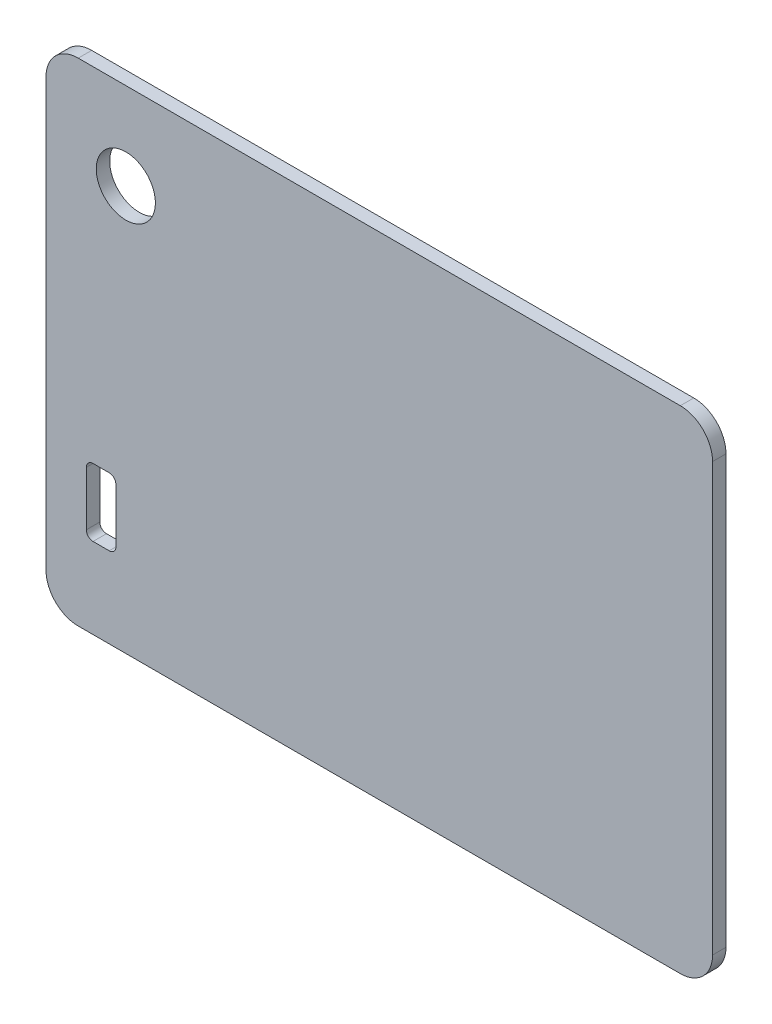
ISO-10303-21;
HEADER;
FILE_DESCRIPTION(('STEP AP214'),'2;1');
FILE_NAME('part.step','',(''),(''),'','','');
FILE_SCHEMA(('AUTOMOTIVE_DESIGN { 1 0 10303 214 1 1 1 1 }'));
ENDSEC;
DATA;
#1=APPLICATION_CONTEXT('core data for automotive mechanical design processes');
#2=APPLICATION_PROTOCOL_DEFINITION('international standard','automotive_design',2000,#1);
#3=PRODUCT_CONTEXT('',#1,'mechanical');
#4=PRODUCT('Part','Part','',(#3));
#5=PRODUCT_RELATED_PRODUCT_CATEGORY('part','',(#4));
#6=PRODUCT_DEFINITION_FORMATION('','',#4);
#7=PRODUCT_DEFINITION_CONTEXT('part definition',#1,'design');
#8=PRODUCT_DEFINITION('design','',#6,#7);
#9=PRODUCT_DEFINITION_SHAPE('','',#8);
#10=(LENGTH_UNIT() NAMED_UNIT(*) SI_UNIT(.MILLI.,.METRE.));
#11=(NAMED_UNIT(*) PLANE_ANGLE_UNIT() SI_UNIT($,.RADIAN.));
#12=(NAMED_UNIT(*) SI_UNIT($,.STERADIAN.) SOLID_ANGLE_UNIT());
#13=UNCERTAINTY_MEASURE_WITH_UNIT(LENGTH_MEASURE(1.E-05),#10,'distance_accuracy_value','');
#14=(GEOMETRIC_REPRESENTATION_CONTEXT(3) GLOBAL_UNCERTAINTY_ASSIGNED_CONTEXT((#13)) GLOBAL_UNIT_ASSIGNED_CONTEXT((#10,
#11,#12)) REPRESENTATION_CONTEXT('',''));
#15=CARTESIAN_POINT('',(0.,0.,0.));
#16=DIRECTION('',(0.,0.,1.));
#17=DIRECTION('',(1.,0.,0.));
#18=AXIS2_PLACEMENT_3D('',#15,#16,#17);
#19=CARTESIAN_POINT('',(18.299999588728,0.,1.));
#20=DIRECTION('',(1.,0.,0.));
#21=DIRECTION('',(0.,1.,0.));
#22=AXIS2_PLACEMENT_3D('',#19,#20,#21);
#23=PLANE('',#22);
#24=DIRECTION('',(0.,-1.,0.));
#25=VECTOR('',#24,1.);
#26=CARTESIAN_POINT('',(18.299999588728,0.,0.));
#27=LINE('',#26,#25);
#28=CARTESIAN_POINT('',(18.2999995887279,15.9000002831221,0.));
#29=VERTEX_POINT('',#28);
#30=CARTESIAN_POINT('',(18.299999588728,-15.899999588728,0.));
#31=VERTEX_POINT('',#30);
#32=EDGE_CURVE('E264',#29,#31,#27,.T.);
#33=ORIENTED_EDGE('',*,*,#32,.F.);
#34=DIRECTION('',(0.,0.,-1.));
#35=VECTOR('',#34,1.);
#36=CARTESIAN_POINT('',(18.2999995887279,15.9000002831221,1.));
#37=LINE('',#36,#35);
#38=CARTESIAN_POINT('',(18.2999995887279,15.9000002831221,1.));
#39=VERTEX_POINT('',#38);
#40=EDGE_CURVE('E11',#39,#29,#37,.T.);
#41=ORIENTED_EDGE('',*,*,#40,.F.);
#42=DIRECTION('',(0.,-1.,0.));
#43=VECTOR('',#42,1.);
#44=CARTESIAN_POINT('',(18.299999588728,0.,1.));
#45=LINE('',#44,#43);
#46=CARTESIAN_POINT('',(18.299999588728,-15.899999588728,1.));
#47=VERTEX_POINT('',#46);
#48=EDGE_CURVE('E328',#39,#47,#45,.T.);
#49=ORIENTED_EDGE('',*,*,#48,.T.);
#50=DIRECTION('',(0.,0.,-1.));
#51=VECTOR('',#50,1.);
#52=CARTESIAN_POINT('',(18.299999588728,-15.899999588728,1.));
#53=LINE('',#52,#51);
#54=EDGE_CURVE('E114',#47,#31,#53,.T.);
#55=ORIENTED_EDGE('',*,*,#54,.T.);
#56=EDGE_LOOP('',(#33,#41,#49,#55));
#57=FACE_BOUND('',#56,.T.);
#58=ADVANCED_FACE('F37',(#57),#23,.T.);
#59=CARTESIAN_POINT('',(15.899999588728,15.9000002831221,1.));
#60=DIRECTION('',(0.,0.,1.));
#61=DIRECTION('',(-0.707106781186548,-0.707106781186547,0.));
#62=AXIS2_PLACEMENT_3D('',#59,#60,#61);
#63=ELLIPSE('',#62,2.4,2.4);
#64=DIRECTION('',(0.,0.,-1.));
#65=VECTOR('',#64,1.);
#66=SURFACE_OF_LINEAR_EXTRUSION('',#63,#65);
#67=CARTESIAN_POINT('',(15.899999588728,15.9000002831221,0.));
#68=DIRECTION('',(0.,0.,1.));
#69=DIRECTION('',(-0.707106781186548,-0.707106781186547,0.));
#70=AXIS2_PLACEMENT_3D('',#67,#68,#69);
#71=ELLIPSE('',#70,2.4,2.4);
#72=CARTESIAN_POINT('',(15.899999588728,18.3000002831221,0.));
#73=VERTEX_POINT('',#72);
#74=EDGE_CURVE('E261',#29,#73,#71,.T.);
#75=ORIENTED_EDGE('',*,*,#74,.T.);
#76=DIRECTION('',(0.,0.,-1.));
#77=VECTOR('',#76,1.);
#78=CARTESIAN_POINT('',(15.899999588728,18.3000002831221,1.));
#79=LINE('',#78,#77);
#80=CARTESIAN_POINT('',(15.899999588728,18.3000002831221,1.));
#81=VERTEX_POINT('',#80);
#82=EDGE_CURVE('E47',#81,#73,#79,.T.);
#83=ORIENTED_EDGE('',*,*,#82,.F.);
#84=EDGE_CURVE('E329',#39,#81,#63,.T.);
#85=ORIENTED_EDGE('',*,*,#84,.F.);
#86=ORIENTED_EDGE('',*,*,#40,.T.);
#87=EDGE_LOOP('',(#75,#83,#85,#86));
#88=FACE_BOUND('',#87,.T.);
#89=ADVANCED_FACE('F306',(#88),#66,.F.);
#90=CARTESIAN_POINT('',(0.,18.3000002831221,1.));
#91=DIRECTION('',(0.,1.,0.));
#92=DIRECTION('',(-1.,0.,0.));
#93=AXIS2_PLACEMENT_3D('',#90,#91,#92);
#94=PLANE('',#93);
#95=DIRECTION('',(1.,0.,0.));
#96=VECTOR('',#95,1.);
#97=CARTESIAN_POINT('',(0.,18.3000002831221,0.));
#98=LINE('',#97,#96);
#99=CARTESIAN_POINT('',(-28.9000004768372,18.3000002831221,0.));
#100=VERTEX_POINT('',#99);
#101=EDGE_CURVE('E258',#100,#73,#98,.T.);
#102=ORIENTED_EDGE('',*,*,#101,.F.);
#103=DIRECTION('',(0.,0.,-1.));
#104=VECTOR('',#103,1.);
#105=CARTESIAN_POINT('',(-28.9000004768372,18.3000002831221,1.));
#106=LINE('',#105,#104);
#107=CARTESIAN_POINT('',(-28.9000004768372,18.3000002831221,1.));
#108=VERTEX_POINT('',#107);
#109=EDGE_CURVE('E224',#108,#100,#106,.T.);
#110=ORIENTED_EDGE('',*,*,#109,.F.);
#111=DIRECTION('',(1.,0.,0.));
#112=VECTOR('',#111,1.);
#113=CARTESIAN_POINT('',(0.,18.3000002831221,1.));
#114=LINE('',#113,#112);
#115=EDGE_CURVE('E215',#108,#81,#114,.T.);
#116=ORIENTED_EDGE('',*,*,#115,.T.);
#117=ORIENTED_EDGE('',*,*,#82,.T.);
#118=EDGE_LOOP('',(#102,#110,#116,#117));
#119=FACE_BOUND('',#118,.T.);
#120=ADVANCED_FACE('F209',(#119),#94,.T.);
#121=CARTESIAN_POINT('',(-28.9000004768372,15.9000002831221,1.));
#122=DIRECTION('',(0.,0.,1.));
#123=DIRECTION('',(0.707106781186548,-0.707106781186548,0.));
#124=AXIS2_PLACEMENT_3D('',#121,#122,#123);
#125=ELLIPSE('',#124,2.4,2.4);
#126=DIRECTION('',(0.,0.,-1.));
#127=VECTOR('',#126,1.);
#128=SURFACE_OF_LINEAR_EXTRUSION('',#125,#127);
#129=CARTESIAN_POINT('',(-28.9000004768372,15.9000002831221,0.));
#130=DIRECTION('',(0.,0.,1.));
#131=DIRECTION('',(0.707106781186548,-0.707106781186548,0.));
#132=AXIS2_PLACEMENT_3D('',#129,#130,#131);
#133=ELLIPSE('',#132,2.4,2.4);
#134=CARTESIAN_POINT('',(-31.3000004768372,15.9000002831221,0.));
#135=VERTEX_POINT('',#134);
#136=EDGE_CURVE('E256',#100,#135,#133,.T.);
#137=ORIENTED_EDGE('',*,*,#136,.T.);
#138=DIRECTION('',(0.,0.,-1.));
#139=VECTOR('',#138,1.);
#140=CARTESIAN_POINT('',(-31.3000004768372,15.9000002831221,1.));
#141=LINE('',#140,#139);
#142=CARTESIAN_POINT('',(-31.3000004768372,15.9000002831221,1.));
#143=VERTEX_POINT('',#142);
#144=EDGE_CURVE('E219',#143,#135,#141,.T.);
#145=ORIENTED_EDGE('',*,*,#144,.F.);
#146=EDGE_CURVE('E212',#108,#143,#125,.T.);
#147=ORIENTED_EDGE('',*,*,#146,.F.);
#148=ORIENTED_EDGE('',*,*,#109,.T.);
#149=EDGE_LOOP('',(#137,#145,#147,#148));
#150=FACE_BOUND('',#149,.T.);
#151=ADVANCED_FACE('F204',(#150),#128,.F.);
#152=CARTESIAN_POINT('',(-31.3000004768372,0.,1.));
#153=DIRECTION('',(-1.,0.,0.));
#154=DIRECTION('',(0.,0.,1.));
#155=AXIS2_PLACEMENT_3D('',#152,#153,#154);
#156=PLANE('',#155);
#157=DIRECTION('',(0.,1.,0.));
#158=VECTOR('',#157,1.);
#159=CARTESIAN_POINT('',(-31.3000004768372,0.,0.));
#160=LINE('',#159,#158);
#161=CARTESIAN_POINT('',(-31.3000004768372,-15.899999588728,0.));
#162=VERTEX_POINT('',#161);
#163=EDGE_CURVE('E222',#162,#135,#160,.T.);
#164=ORIENTED_EDGE('',*,*,#163,.F.);
#165=DIRECTION('',(0.,0.,-1.));
#166=VECTOR('',#165,1.);
#167=CARTESIAN_POINT('',(-31.3000004768372,-15.899999588728,1.));
#168=LINE('',#167,#166);
#169=CARTESIAN_POINT('',(-31.3000004768372,-15.899999588728,1.));
#170=VERTEX_POINT('',#169);
#171=EDGE_CURVE('E177',#170,#162,#168,.T.);
#172=ORIENTED_EDGE('',*,*,#171,.F.);
#173=DIRECTION('',(0.,1.,0.));
#174=VECTOR('',#173,1.);
#175=CARTESIAN_POINT('',(-31.3000004768372,0.,1.));
#176=LINE('',#175,#174);
#177=EDGE_CURVE('E166',#170,#143,#176,.T.);
#178=ORIENTED_EDGE('',*,*,#177,.T.);
#179=ORIENTED_EDGE('',*,*,#144,.T.);
#180=EDGE_LOOP('',(#164,#172,#178,#179));
#181=FACE_BOUND('',#180,.T.);
#182=ADVANCED_FACE('F201',(#181),#156,.T.);
#183=CARTESIAN_POINT('',(-28.9000004768372,-15.899999588728,1.));
#184=DIRECTION('',(0.,0.,1.));
#185=DIRECTION('',(0.707106781186547,-0.707106781186548,0.));
#186=AXIS2_PLACEMENT_3D('',#183,#184,#185);
#187=ELLIPSE('',#186,2.4,2.39999999999999);
#188=DIRECTION('',(0.,0.,-1.));
#189=VECTOR('',#188,1.);
#190=SURFACE_OF_LINEAR_EXTRUSION('',#187,#189);
#191=CARTESIAN_POINT('',(-28.9000004768372,-15.899999588728,0.));
#192=DIRECTION('',(0.,0.,1.));
#193=DIRECTION('',(0.707106781186547,-0.707106781186548,0.));
#194=AXIS2_PLACEMENT_3D('',#191,#192,#193);
#195=ELLIPSE('',#194,2.4,2.39999999999999);
#196=CARTESIAN_POINT('',(-28.9000004768372,-18.299999588728,0.));
#197=VERTEX_POINT('',#196);
#198=EDGE_CURVE('E173',#162,#197,#195,.T.);
#199=ORIENTED_EDGE('',*,*,#198,.T.);
#200=DIRECTION('',(0.,0.,-1.));
#201=VECTOR('',#200,1.);
#202=CARTESIAN_POINT('',(-28.9000004768372,-18.299999588728,1.));
#203=LINE('',#202,#201);
#204=CARTESIAN_POINT('',(-28.9000004768372,-18.299999588728,1.));
#205=VERTEX_POINT('',#204);
#206=EDGE_CURVE('E170',#205,#197,#203,.T.);
#207=ORIENTED_EDGE('',*,*,#206,.F.);
#208=EDGE_CURVE('E160',#170,#205,#187,.T.);
#209=ORIENTED_EDGE('',*,*,#208,.F.);
#210=ORIENTED_EDGE('',*,*,#171,.T.);
#211=EDGE_LOOP('',(#199,#207,#209,#210));
#212=FACE_BOUND('',#211,.T.);
#213=ADVANCED_FACE('F171',(#212),#190,.F.);
#214=CARTESIAN_POINT('',(0.,-18.299999588728,1.));
#215=DIRECTION('',(0.,-1.,0.));
#216=DIRECTION('',(0.,0.,-1.));
#217=AXIS2_PLACEMENT_3D('',#214,#215,#216);
#218=PLANE('',#217);
#219=DIRECTION('',(-1.,0.,0.));
#220=VECTOR('',#219,1.);
#221=CARTESIAN_POINT('',(0.,-18.299999588728,0.));
#222=LINE('',#221,#220);
#223=CARTESIAN_POINT('',(15.899999588728,-18.299999588728,0.));
#224=VERTEX_POINT('',#223);
#225=EDGE_CURVE('E252',#224,#197,#222,.T.);
#226=ORIENTED_EDGE('',*,*,#225,.F.);
#227=DIRECTION('',(0.,0.,-1.));
#228=VECTOR('',#227,1.);
#229=CARTESIAN_POINT('',(15.899999588728,-18.299999588728,1.));
#230=LINE('',#229,#228);
#231=CARTESIAN_POINT('',(15.899999588728,-18.299999588728,1.));
#232=VERTEX_POINT('',#231);
#233=EDGE_CURVE('E107',#232,#224,#230,.T.);
#234=ORIENTED_EDGE('',*,*,#233,.F.);
#235=DIRECTION('',(-1.,0.,0.));
#236=VECTOR('',#235,1.);
#237=CARTESIAN_POINT('',(0.,-18.299999588728,1.));
#238=LINE('',#237,#236);
#239=EDGE_CURVE('E164',#232,#205,#238,.T.);
#240=ORIENTED_EDGE('',*,*,#239,.T.);
#241=ORIENTED_EDGE('',*,*,#206,.T.);
#242=EDGE_LOOP('',(#226,#234,#240,#241));
#243=FACE_BOUND('',#242,.T.);
#244=ADVANCED_FACE('F179',(#243),#218,.T.);
#245=CARTESIAN_POINT('',(-27.8000004768372,-11.797102243238,1.));
#246=DIRECTION('',(0.,0.,1.));
#247=DIRECTION('',(0.707106781186541,0.707106781186554,0.));
#248=AXIS2_PLACEMENT_3D('',#245,#246,#247);
#249=ELLIPSE('',#248,0.500000000000028,0.500000000000003);
#250=DIRECTION('',(0.,0.,-1.));
#251=VECTOR('',#250,1.);
#252=SURFACE_OF_LINEAR_EXTRUSION('',#249,#251);
#253=CARTESIAN_POINT('',(-27.8000004768372,-11.797102243238,0.));
#254=DIRECTION('',(0.,0.,1.));
#255=DIRECTION('',(0.707106781186541,0.707106781186554,0.));
#256=AXIS2_PLACEMENT_3D('',#253,#254,#255);
#257=ELLIPSE('',#256,0.500000000000028,0.500000000000003);
#258=CARTESIAN_POINT('',(-28.3000004768372,-11.797102243238,0.));
#259=VERTEX_POINT('',#258);
#260=CARTESIAN_POINT('',(-27.8000004768372,-12.297102243238,0.));
#261=VERTEX_POINT('',#260);
#262=EDGE_CURVE('E287',#259,#261,#257,.T.);
#263=ORIENTED_EDGE('',*,*,#262,.F.);
#264=DIRECTION('',(0.,0.,-1.));
#265=VECTOR('',#264,1.);
#266=CARTESIAN_POINT('',(-28.3000004768372,-11.797102243238,1.));
#267=LINE('',#266,#265);
#268=CARTESIAN_POINT('',(-28.3000004768372,-11.797102243238,1.));
#269=VERTEX_POINT('',#268);
#270=EDGE_CURVE('E41',#269,#259,#267,.T.);
#271=ORIENTED_EDGE('',*,*,#270,.F.);
#272=CARTESIAN_POINT('',(-27.8000004768372,-12.297102243238,1.));
#273=VERTEX_POINT('',#272);
#274=EDGE_CURVE('E351',#269,#273,#249,.T.);
#275=ORIENTED_EDGE('',*,*,#274,.T.);
#276=DIRECTION('',(0.,0.,-1.));
#277=VECTOR('',#276,1.);
#278=CARTESIAN_POINT('',(-27.8000004768372,-12.297102243238,1.));
#279=LINE('',#278,#277);
#280=EDGE_CURVE('E181',#273,#261,#279,.T.);
#281=ORIENTED_EDGE('',*,*,#280,.T.);
#282=EDGE_LOOP('',(#263,#271,#275,#281));
#283=FACE_BOUND('',#282,.T.);
#284=ADVANCED_FACE('F198',(#283),#252,.T.);
#285=CARTESIAN_POINT('',(-28.3000004768372,0.,1.));
#286=DIRECTION('',(1.,0.,0.));
#287=DIRECTION('',(0.,1.,0.));
#288=AXIS2_PLACEMENT_3D('',#285,#286,#287);
#289=PLANE('',#288);
#290=DIRECTION('',(0.,-1.,0.));
#291=VECTOR('',#290,1.);
#292=CARTESIAN_POINT('',(-28.3000004768372,0.,0.));
#293=LINE('',#292,#291);
#294=CARTESIAN_POINT('',(-28.3000004768372,-7.77163095485123,0.));
#295=VERTEX_POINT('',#294);
#296=EDGE_CURVE('E285',#295,#259,#293,.T.);
#297=ORIENTED_EDGE('',*,*,#296,.F.);
#298=DIRECTION('',(0.,0.,-1.));
#299=VECTOR('',#298,1.);
#300=CARTESIAN_POINT('',(-28.3000004768372,-7.77163095485123,1.));
#301=LINE('',#300,#299);
#302=CARTESIAN_POINT('',(-28.3000004768372,-7.77163095485123,1.));
#303=VERTEX_POINT('',#302);
#304=EDGE_CURVE('E240',#303,#295,#301,.T.);
#305=ORIENTED_EDGE('',*,*,#304,.F.);
#306=DIRECTION('',(0.,-1.,0.));
#307=VECTOR('',#306,1.);
#308=CARTESIAN_POINT('',(-28.3000004768372,0.,1.));
#309=LINE('',#308,#307);
#310=EDGE_CURVE('E353',#303,#269,#309,.T.);
#311=ORIENTED_EDGE('',*,*,#310,.T.);
#312=ORIENTED_EDGE('',*,*,#270,.T.);
#313=EDGE_LOOP('',(#297,#305,#311,#312));
#314=FACE_BOUND('',#313,.T.);
#315=ADVANCED_FACE('F358',(#314),#289,.T.);
#316=CARTESIAN_POINT('',(-27.8000004768372,-7.77163095485123,1.));
#317=DIRECTION('',(0.,0.,1.));
#318=DIRECTION('',(0.707106781186548,0.707106781186548,0.));
#319=AXIS2_PLACEMENT_3D('',#316,#317,#318);
#320=ELLIPSE('',#319,0.500000000000003,0.499999999999999);
#321=DIRECTION('',(0.,0.,-1.));
#322=VECTOR('',#321,1.);
#323=SURFACE_OF_LINEAR_EXTRUSION('',#320,#322);
#324=CARTESIAN_POINT('',(-27.8000004768372,-7.77163095485123,0.));
#325=DIRECTION('',(0.,0.,1.));
#326=DIRECTION('',(0.707106781186548,0.707106781186548,0.));
#327=AXIS2_PLACEMENT_3D('',#324,#325,#326);
#328=ELLIPSE('',#327,0.500000000000003,0.499999999999999);
#329=CARTESIAN_POINT('',(-27.8000004768372,-7.27163095485123,0.));
#330=VERTEX_POINT('',#329);
#331=EDGE_CURVE('E282',#330,#295,#328,.T.);
#332=ORIENTED_EDGE('',*,*,#331,.F.);
#333=DIRECTION('',(0.,0.,-1.));
#334=VECTOR('',#333,1.);
#335=CARTESIAN_POINT('',(-27.8000004768372,-7.27163095485123,1.));
#336=LINE('',#335,#334);
#337=CARTESIAN_POINT('',(-27.8000004768372,-7.27163095485123,1.));
#338=VERTEX_POINT('',#337);
#339=EDGE_CURVE('E239',#338,#330,#336,.T.);
#340=ORIENTED_EDGE('',*,*,#339,.F.);
#341=EDGE_CURVE('E359',#338,#303,#320,.T.);
#342=ORIENTED_EDGE('',*,*,#341,.T.);
#343=ORIENTED_EDGE('',*,*,#304,.T.);
#344=EDGE_LOOP('',(#332,#340,#342,#343));
#345=FACE_BOUND('',#344,.T.);
#346=ADVANCED_FACE('F368',(#345),#323,.T.);
#347=CARTESIAN_POINT('',(0.,-7.27163095485157,1.));
#348=DIRECTION('',(0.,-1.,0.));
#349=DIRECTION('',(1.,0.,0.));
#350=AXIS2_PLACEMENT_3D('',#347,#348,#349);
#351=PLANE('',#350);
#352=DIRECTION('',(-1.,0.,0.));
#353=VECTOR('',#352,1.);
#354=CARTESIAN_POINT('',(0.,-7.27163095485157,0.));
#355=LINE('',#354,#353);
#356=CARTESIAN_POINT('',(-26.6000004768372,-7.27163095485124,0.));
#357=VERTEX_POINT('',#356);
#358=EDGE_CURVE('E279',#357,#330,#355,.T.);
#359=ORIENTED_EDGE('',*,*,#358,.F.);
#360=DIRECTION('',(0.,0.,-1.));
#361=VECTOR('',#360,1.);
#362=CARTESIAN_POINT('',(-26.6000004768372,-7.27163095485124,1.));
#363=LINE('',#362,#361);
#364=CARTESIAN_POINT('',(-26.6000004768372,-7.27163095485124,1.));
#365=VERTEX_POINT('',#364);
#366=EDGE_CURVE('E237',#365,#357,#363,.T.);
#367=ORIENTED_EDGE('',*,*,#366,.F.);
#368=DIRECTION('',(-1.,0.,0.));
#369=VECTOR('',#368,1.);
#370=CARTESIAN_POINT('',(0.,-7.27163095485157,1.));
#371=LINE('',#370,#369);
#372=EDGE_CURVE('E361',#365,#338,#371,.T.);
#373=ORIENTED_EDGE('',*,*,#372,.T.);
#374=ORIENTED_EDGE('',*,*,#339,.T.);
#375=EDGE_LOOP('',(#359,#367,#373,#374));
#376=FACE_BOUND('',#375,.T.);
#377=ADVANCED_FACE('F372',(#376),#351,.T.);
#378=CARTESIAN_POINT('',(-26.6000004768372,-7.77163095485124,1.));
#379=DIRECTION('',(0.,0.,1.));
#380=DIRECTION('',(0.707106781186549,0.707106781186546,0.));
#381=AXIS2_PLACEMENT_3D('',#378,#379,#380);
#382=ELLIPSE('',#381,0.500000000000002,0.499999999999998);
#383=DIRECTION('',(0.,0.,-1.));
#384=VECTOR('',#383,1.);
#385=SURFACE_OF_LINEAR_EXTRUSION('',#382,#384);
#386=CARTESIAN_POINT('',(-26.6000004768372,-7.77163095485124,0.));
#387=DIRECTION('',(0.,0.,1.));
#388=DIRECTION('',(0.707106781186549,0.707106781186546,0.));
#389=AXIS2_PLACEMENT_3D('',#386,#387,#388);
#390=ELLIPSE('',#389,0.500000000000002,0.499999999999998);
#391=CARTESIAN_POINT('',(-26.1000004768372,-7.77163095485124,0.));
#392=VERTEX_POINT('',#391);
#393=EDGE_CURVE('E276',#392,#357,#390,.T.);
#394=ORIENTED_EDGE('',*,*,#393,.F.);
#395=DIRECTION('',(0.,0.,-1.));
#396=VECTOR('',#395,1.);
#397=CARTESIAN_POINT('',(-26.1000004768372,-7.77163095485124,1.));
#398=LINE('',#397,#396);
#399=CARTESIAN_POINT('',(-26.1000004768372,-7.77163095485124,1.));
#400=VERTEX_POINT('',#399);
#401=EDGE_CURVE('E235',#400,#392,#398,.T.);
#402=ORIENTED_EDGE('',*,*,#401,.F.);
#403=EDGE_CURVE('E383',#400,#365,#382,.T.);
#404=ORIENTED_EDGE('',*,*,#403,.T.);
#405=ORIENTED_EDGE('',*,*,#366,.T.);
#406=EDGE_LOOP('',(#394,#402,#404,#405));
#407=FACE_BOUND('',#406,.T.);
#408=ADVANCED_FACE('F386',(#407),#385,.T.);
#409=CARTESIAN_POINT('',(-26.1000004768372,0.,1.));
#410=DIRECTION('',(1.,0.,0.));
#411=DIRECTION('',(0.,1.,0.));
#412=AXIS2_PLACEMENT_3D('',#409,#410,#411);
#413=PLANE('',#412);
#414=DIRECTION('',(0.,-1.,0.));
#415=VECTOR('',#414,1.);
#416=CARTESIAN_POINT('',(-26.1000004768372,0.,0.));
#417=LINE('',#416,#415);
#418=CARTESIAN_POINT('',(-26.1000004768372,-11.797102243238,0.));
#419=VERTEX_POINT('',#418);
#420=EDGE_CURVE('E273',#392,#419,#417,.T.);
#421=ORIENTED_EDGE('',*,*,#420,.T.);
#422=DIRECTION('',(0.,0.,-1.));
#423=VECTOR('',#422,1.);
#424=CARTESIAN_POINT('',(-26.1000004768372,-11.797102243238,1.));
#425=LINE('',#424,#423);
#426=CARTESIAN_POINT('',(-26.1000004768372,-11.797102243238,1.));
#427=VERTEX_POINT('',#426);
#428=EDGE_CURVE('E233',#427,#419,#425,.T.);
#429=ORIENTED_EDGE('',*,*,#428,.F.);
#430=DIRECTION('',(0.,-1.,0.));
#431=VECTOR('',#430,1.);
#432=CARTESIAN_POINT('',(-26.1000004768372,0.,1.));
#433=LINE('',#432,#431);
#434=EDGE_CURVE('E325',#400,#427,#433,.T.);
#435=ORIENTED_EDGE('',*,*,#434,.F.);
#436=ORIENTED_EDGE('',*,*,#401,.T.);
#437=EDGE_LOOP('',(#421,#429,#435,#436));
#438=FACE_BOUND('',#437,.T.);
#439=ADVANCED_FACE('F316',(#438),#413,.F.);
#440=CARTESIAN_POINT('',(-26.6000004768372,-11.797102243238,1.));
#441=DIRECTION('',(0.,0.,1.));
#442=DIRECTION('',(0.707106781186551,-0.707106781186544,0.));
#443=AXIS2_PLACEMENT_3D('',#440,#441,#442);
#444=ELLIPSE('',#443,0.500000000000006,0.499999999999991);
#445=DIRECTION('',(0.,0.,-1.));
#446=VECTOR('',#445,1.);
#447=SURFACE_OF_LINEAR_EXTRUSION('',#444,#446);
#448=CARTESIAN_POINT('',(-26.6000004768372,-11.797102243238,0.));
#449=DIRECTION('',(0.,0.,1.));
#450=DIRECTION('',(0.707106781186551,-0.707106781186544,0.));
#451=AXIS2_PLACEMENT_3D('',#448,#449,#450);
#452=ELLIPSE('',#451,0.500000000000006,0.499999999999991);
#453=CARTESIAN_POINT('',(-26.6000004768372,-12.297102243238,0.));
#454=VERTEX_POINT('',#453);
#455=EDGE_CURVE('E270',#454,#419,#452,.T.);
#456=ORIENTED_EDGE('',*,*,#455,.F.);
#457=DIRECTION('',(0.,0.,-1.));
#458=VECTOR('',#457,1.);
#459=CARTESIAN_POINT('',(-26.6000004768372,-12.297102243238,1.));
#460=LINE('',#459,#458);
#461=CARTESIAN_POINT('',(-26.6000004768372,-12.297102243238,1.));
#462=VERTEX_POINT('',#461);
#463=EDGE_CURVE('E231',#462,#454,#460,.T.);
#464=ORIENTED_EDGE('',*,*,#463,.F.);
#465=EDGE_CURVE('E319',#462,#427,#444,.T.);
#466=ORIENTED_EDGE('',*,*,#465,.T.);
#467=ORIENTED_EDGE('',*,*,#428,.T.);
#468=EDGE_LOOP('',(#456,#464,#466,#467));
#469=FACE_BOUND('',#468,.T.);
#470=ADVANCED_FACE('F301',(#469),#447,.T.);
#471=CARTESIAN_POINT('',(0.,-12.2971022432381,1.));
#472=DIRECTION('',(0.,-1.,0.));
#473=DIRECTION('',(1.,0.,0.));
#474=AXIS2_PLACEMENT_3D('',#471,#472,#473);
#475=PLANE('',#474);
#476=DIRECTION('',(-1.,0.,0.));
#477=VECTOR('',#476,1.);
#478=CARTESIAN_POINT('',(0.,-12.2971022432381,0.));
#479=LINE('',#478,#477);
#480=EDGE_CURVE('E267',#454,#261,#479,.T.);
#481=ORIENTED_EDGE('',*,*,#480,.T.);
#482=ORIENTED_EDGE('',*,*,#280,.F.);
#483=DIRECTION('',(-1.,0.,0.));
#484=VECTOR('',#483,1.);
#485=CARTESIAN_POINT('',(0.,-12.2971022432381,1.));
#486=LINE('',#485,#484);
#487=EDGE_CURVE('E324',#462,#273,#486,.T.);
#488=ORIENTED_EDGE('',*,*,#487,.F.);
#489=ORIENTED_EDGE('',*,*,#463,.T.);
#490=EDGE_LOOP('',(#481,#482,#488,#489));
#491=FACE_BOUND('',#490,.T.);
#492=ADVANCED_FACE('F296',(#491),#475,.F.);
#493=CARTESIAN_POINT('',(-25.3600004768372,11.8300002831221,1.));
#494=DIRECTION('',(0.,0.,-1.));
#495=DIRECTION('',(-1.,0.,0.));
#496=AXIS2_PLACEMENT_3D('',#493,#494,#495);
#497=CYLINDRICAL_SURFACE('',#496,2.2);
#498=CARTESIAN_POINT('',(-25.3600004768372,11.8300002831221,1.));
#499=DIRECTION('',(0.,0.,1.));
#500=DIRECTION('',(1.,0.,0.));
#501=AXIS2_PLACEMENT_3D('',#498,#499,#500);
#502=CIRCLE('',#501,2.2);
#503=CARTESIAN_POINT('',(-23.1600004768372,11.8300002831221,1.));
#504=VERTEX_POINT('',#503);
#505=EDGE_CURVE('E251',#504,#504,#502,.T.);
#506=ORIENTED_EDGE('',*,*,#505,.T.);
#507=EDGE_LOOP('',(#506));
#508=FACE_BOUND('',#507,.T.);
#509=CARTESIAN_POINT('',(-25.3600004768372,11.8300002831221,0.));
#510=DIRECTION('',(0.,0.,1.));
#511=DIRECTION('',(1.,0.,0.));
#512=AXIS2_PLACEMENT_3D('',#509,#510,#511);
#513=CIRCLE('',#512,2.2);
#514=CARTESIAN_POINT('',(-23.1600004768372,11.8300002831221,0.));
#515=VERTEX_POINT('',#514);
#516=EDGE_CURVE('E187',#515,#515,#513,.T.);
#517=ORIENTED_EDGE('',*,*,#516,.F.);
#518=EDGE_LOOP('',(#517));
#519=FACE_BOUND('',#518,.T.);
#520=ADVANCED_FACE('F39',(#508,#519),#497,.F.);
#521=CARTESIAN_POINT('',(15.899999588728,-15.899999588728,1.));
#522=DIRECTION('',(0.,0.,1.));
#523=DIRECTION('',(0.707106781186548,-0.707106781186548,0.));
#524=AXIS2_PLACEMENT_3D('',#521,#522,#523);
#525=ELLIPSE('',#524,2.39999999999999,2.39999999999999);
#526=DIRECTION('',(0.,0.,-1.));
#527=VECTOR('',#526,1.);
#528=SURFACE_OF_LINEAR_EXTRUSION('',#525,#527);
#529=CARTESIAN_POINT('',(15.899999588728,-15.899999588728,0.));
#530=DIRECTION('',(0.,0.,1.));
#531=DIRECTION('',(0.707106781186548,-0.707106781186548,0.));
#532=AXIS2_PLACEMENT_3D('',#529,#530,#531);
#533=ELLIPSE('',#532,2.39999999999999,2.39999999999999);
#534=EDGE_CURVE('E249',#224,#31,#533,.T.);
#535=ORIENTED_EDGE('',*,*,#534,.T.);
#536=ORIENTED_EDGE('',*,*,#54,.F.);
#537=EDGE_CURVE('E56',#232,#47,#525,.T.);
#538=ORIENTED_EDGE('',*,*,#537,.F.);
#539=ORIENTED_EDGE('',*,*,#233,.T.);
#540=EDGE_LOOP('',(#535,#536,#538,#539));
#541=FACE_BOUND('',#540,.T.);
#542=ADVANCED_FACE('F190',(#541),#528,.F.);
#543=CARTESIAN_POINT('',(0.,0.,1.));
#544=DIRECTION('',(0.,0.,1.));
#545=DIRECTION('',(1.,0.,0.));
#546=AXIS2_PLACEMENT_3D('',#543,#544,#545);
#547=PLANE('',#546);
#548=ORIENTED_EDGE('',*,*,#505,.F.);
#549=EDGE_LOOP('',(#548));
#550=FACE_BOUND('',#549,.T.);
#551=ORIENTED_EDGE('',*,*,#274,.F.);
#552=ORIENTED_EDGE('',*,*,#310,.F.);
#553=ORIENTED_EDGE('',*,*,#341,.F.);
#554=ORIENTED_EDGE('',*,*,#372,.F.);
#555=ORIENTED_EDGE('',*,*,#403,.F.);
#556=ORIENTED_EDGE('',*,*,#434,.T.);
#557=ORIENTED_EDGE('',*,*,#465,.F.);
#558=ORIENTED_EDGE('',*,*,#487,.T.);
#559=EDGE_LOOP('',(#551,#552,#553,#554,#555,#556,#557,#558));
#560=FACE_BOUND('',#559,.T.);
#561=ORIENTED_EDGE('',*,*,#48,.F.);
#562=ORIENTED_EDGE('',*,*,#84,.T.);
#563=ORIENTED_EDGE('',*,*,#115,.F.);
#564=ORIENTED_EDGE('',*,*,#146,.T.);
#565=ORIENTED_EDGE('',*,*,#177,.F.);
#566=ORIENTED_EDGE('',*,*,#208,.T.);
#567=ORIENTED_EDGE('',*,*,#239,.F.);
#568=ORIENTED_EDGE('',*,*,#537,.T.);
#569=EDGE_LOOP('',(#561,#562,#563,#564,#565,#566,#567,#568));
#570=FACE_BOUND('',#569,.T.);
#571=ADVANCED_FACE('F162',(#550,#560,#570),#547,.T.);
#572=CARTESIAN_POINT('',(0.,0.,0.));
#573=DIRECTION('',(0.,0.,1.));
#574=DIRECTION('',(1.,0.,0.));
#575=AXIS2_PLACEMENT_3D('',#572,#573,#574);
#576=PLANE('',#575);
#577=ORIENTED_EDGE('',*,*,#516,.T.);
#578=EDGE_LOOP('',(#577));
#579=FACE_BOUND('',#578,.T.);
#580=ORIENTED_EDGE('',*,*,#262,.T.);
#581=ORIENTED_EDGE('',*,*,#480,.F.);
#582=ORIENTED_EDGE('',*,*,#455,.T.);
#583=ORIENTED_EDGE('',*,*,#420,.F.);
#584=ORIENTED_EDGE('',*,*,#393,.T.);
#585=ORIENTED_EDGE('',*,*,#358,.T.);
#586=ORIENTED_EDGE('',*,*,#331,.T.);
#587=ORIENTED_EDGE('',*,*,#296,.T.);
#588=EDGE_LOOP('',(#580,#581,#582,#583,#584,#585,#586,#587));
#589=FACE_BOUND('',#588,.T.);
#590=ORIENTED_EDGE('',*,*,#32,.T.);
#591=ORIENTED_EDGE('',*,*,#534,.F.);
#592=ORIENTED_EDGE('',*,*,#225,.T.);
#593=ORIENTED_EDGE('',*,*,#198,.F.);
#594=ORIENTED_EDGE('',*,*,#163,.T.);
#595=ORIENTED_EDGE('',*,*,#136,.F.);
#596=ORIENTED_EDGE('',*,*,#101,.T.);
#597=ORIENTED_EDGE('',*,*,#74,.F.);
#598=EDGE_LOOP('',(#590,#591,#592,#593,#594,#595,#596,#597));
#599=FACE_BOUND('',#598,.T.);
#600=ADVANCED_FACE('F194',(#579,#589,#599),#576,.F.);
#601=CLOSED_SHELL('',(#58,#89,#120,#151,#182,#213,#244,#284,#315,#346,#377,#408,#439,#470,#492,
#520,#542,#571,#600));
#602=MANIFOLD_SOLID_BREP('B2',#601);
#603=ADVANCED_BREP_SHAPE_REPRESENTATION('',(#18,#602),#14);
#604=SHAPE_DEFINITION_REPRESENTATION(#9,#603);
ENDSEC;
END-ISO-10303-21;
